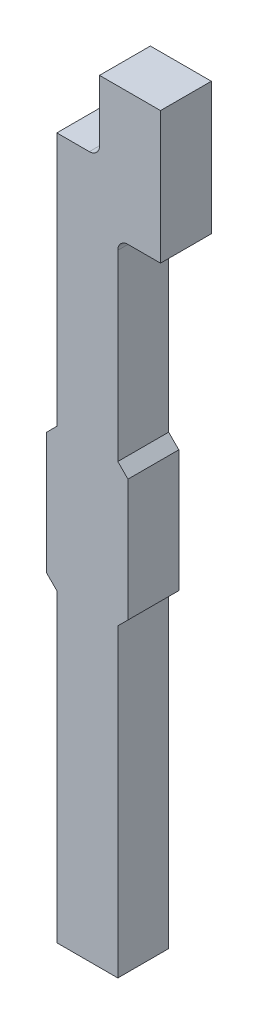
ISO-10303-21;
HEADER;
FILE_DESCRIPTION(('STEP AP214'),'2;1');
FILE_NAME('part.step','',(''),(''),'','','');
FILE_SCHEMA(('AUTOMOTIVE_DESIGN { 1 0 10303 214 1 1 1 1 }'));
ENDSEC;
DATA;
#1=APPLICATION_CONTEXT('core data for automotive mechanical design processes');
#2=APPLICATION_PROTOCOL_DEFINITION('international standard','automotive_design',2000,#1);
#3=PRODUCT_CONTEXT('',#1,'mechanical');
#4=PRODUCT('Part','Part','',(#3));
#5=PRODUCT_RELATED_PRODUCT_CATEGORY('part','',(#4));
#6=PRODUCT_DEFINITION_FORMATION('','',#4);
#7=PRODUCT_DEFINITION_CONTEXT('part definition',#1,'design');
#8=PRODUCT_DEFINITION('design','',#6,#7);
#9=PRODUCT_DEFINITION_SHAPE('','',#8);
#10=(LENGTH_UNIT() NAMED_UNIT(*) SI_UNIT(.MILLI.,.METRE.));
#11=(NAMED_UNIT(*) PLANE_ANGLE_UNIT() SI_UNIT($,.RADIAN.));
#12=(NAMED_UNIT(*) SI_UNIT($,.STERADIAN.) SOLID_ANGLE_UNIT());
#13=UNCERTAINTY_MEASURE_WITH_UNIT(LENGTH_MEASURE(1.E-05),#10,'distance_accuracy_value','');
#14=(GEOMETRIC_REPRESENTATION_CONTEXT(3) GLOBAL_UNCERTAINTY_ASSIGNED_CONTEXT((#13)) GLOBAL_UNIT_ASSIGNED_CONTEXT((#10,
#11,#12)) REPRESENTATION_CONTEXT('',''));
#15=CARTESIAN_POINT('',(0.,0.,0.));
#16=DIRECTION('',(0.,0.,1.));
#17=DIRECTION('',(1.,0.,0.));
#18=AXIS2_PLACEMENT_3D('',#15,#16,#17);
#19=CARTESIAN_POINT('',(-0.996637931034,-0.713362068966,0.));
#20=DIRECTION('',(0.,0.,1.));
#21=DIRECTION('',(1.,0.,0.));
#22=AXIS2_PLACEMENT_3D('',#19,#20,#21);
#23=PLANE('',#22);
#24=CARTESIAN_POINT('',(-1.25,-0.6,0.));
#25=DIRECTION('',(0.,0.,1.));
#26=DIRECTION('',(1.,0.,0.));
#27=AXIS2_PLACEMENT_3D('',#24,#25,#26);
#28=CIRCLE('',#27,0.1);
#29=CARTESIAN_POINT('',(-1.25,-0.7,0.));
#30=VERTEX_POINT('',#29);
#31=CARTESIAN_POINT('',(-1.15,-0.6,0.));
#32=VERTEX_POINT('',#31);
#33=EDGE_CURVE('E288',#30,#32,#28,.T.);
#34=ORIENTED_EDGE('',*,*,#33,.T.);
#35=DIRECTION('',(0.,1.,0.));
#36=VECTOR('',#35,1.);
#37=CARTESIAN_POINT('',(-1.15,-0.35,0.));
#38=LINE('',#37,#36);
#39=CARTESIAN_POINT('',(-1.15,0.,0.));
#40=VERTEX_POINT('',#39);
#41=EDGE_CURVE('E296',#40,#32,#38,.F.);
#42=ORIENTED_EDGE('',*,*,#41,.F.);
#43=DIRECTION('',(1.,0.,0.));
#44=VECTOR('',#43,1.);
#45=CARTESIAN_POINT('',(-0.996637931034,0.,0.));
#46=LINE('',#45,#44);
#47=CARTESIAN_POINT('',(-0.55,0.,0.));
#48=VERTEX_POINT('',#47);
#49=EDGE_CURVE('E299',#48,#40,#46,.F.);
#50=ORIENTED_EDGE('',*,*,#49,.F.);
#51=DIRECTION('',(0.,1.,0.));
#52=VECTOR('',#51,1.);
#53=CARTESIAN_POINT('',(-0.55,-0.713362068966,0.));
#54=LINE('',#53,#52);
#55=CARTESIAN_POINT('',(-0.55,-1.3,0.));
#56=VERTEX_POINT('',#55);
#57=EDGE_CURVE('E305',#56,#48,#54,.T.);
#58=ORIENTED_EDGE('',*,*,#57,.F.);
#59=DIRECTION('',(1.,0.,0.));
#60=VECTOR('',#59,1.);
#61=CARTESIAN_POINT('',(-0.996637931034,-1.3,0.));
#62=LINE('',#61,#60);
#63=CARTESIAN_POINT('',(-0.87,-1.3,0.));
#64=VERTEX_POINT('',#63);
#65=EDGE_CURVE('E144',#64,#56,#62,.T.);
#66=ORIENTED_EDGE('',*,*,#65,.F.);
#67=CARTESIAN_POINT('',(-0.87,-1.4,0.));
#68=DIRECTION('',(0.,0.,-1.));
#69=DIRECTION('',(-1.,0.,0.));
#70=AXIS2_PLACEMENT_3D('',#67,#68,#69);
#71=CIRCLE('',#70,0.1);
#72=CARTESIAN_POINT('',(-0.97,-1.4,0.));
#73=VERTEX_POINT('',#72);
#74=EDGE_CURVE('E20',#73,#64,#71,.T.);
#75=ORIENTED_EDGE('',*,*,#74,.F.);
#76=DIRECTION('',(0.,1.,0.));
#77=VECTOR('',#76,1.);
#78=CARTESIAN_POINT('',(-0.97,-2.25,0.));
#79=LINE('',#78,#77);
#80=CARTESIAN_POINT('',(-0.97,-3.2,0.));
#81=VERTEX_POINT('',#80);
#82=EDGE_CURVE('E141',#81,#73,#79,.T.);
#83=ORIENTED_EDGE('',*,*,#82,.F.);
#84=DIRECTION('',(-0.707106781186548,0.707106781186548,0.));
#85=VECTOR('',#84,1.);
#86=CARTESIAN_POINT('',(-0.91999999867,-3.25000000133,0.));
#87=LINE('',#86,#85);
#88=CARTESIAN_POINT('',(-0.869999997339,-3.300000002661,0.));
#89=VERTEX_POINT('',#88);
#90=EDGE_CURVE('E180',#89,#81,#87,.T.);
#91=ORIENTED_EDGE('',*,*,#90,.F.);
#92=DIRECTION('',(0.,1.,0.));
#93=VECTOR('',#92,1.);
#94=CARTESIAN_POINT('',(-0.869999997339,-3.900000002661,0.));
#95=LINE('',#94,#93);
#96=CARTESIAN_POINT('',(-0.869999997339166,-4.50000000266083,0.));
#97=VERTEX_POINT('',#96);
#98=EDGE_CURVE('E191',#97,#89,#95,.T.);
#99=ORIENTED_EDGE('',*,*,#98,.F.);
#100=DIRECTION('',(0.707106781186548,0.707106781186548,0.));
#101=VECTOR('',#100,1.);
#102=CARTESIAN_POINT('',(-0.91999999867,-4.550000003991,0.));
#103=LINE('',#102,#101);
#104=CARTESIAN_POINT('',(-0.970000001182667,-4.6000000057645,0.));
#105=VERTEX_POINT('',#104);
#106=EDGE_CURVE('E202',#105,#97,#103,.T.);
#107=ORIENTED_EDGE('',*,*,#106,.F.);
#108=DIRECTION('',(0.,1.,0.));
#109=VECTOR('',#108,1.);
#110=CARTESIAN_POINT('',(-0.970000002661,-6.100000002661,0.));
#111=LINE('',#110,#109);
#112=CARTESIAN_POINT('',(-0.970000002661,-7.600000002661,0.));
#113=VERTEX_POINT('',#112);
#114=EDGE_CURVE('E213',#113,#105,#111,.T.);
#115=ORIENTED_EDGE('',*,*,#114,.F.);
#116=DIRECTION('',(1.,0.,0.));
#117=VECTOR('',#116,1.);
#118=CARTESIAN_POINT('',(-1.270000002661,-7.600000002661,0.));
#119=LINE('',#118,#117);
#120=CARTESIAN_POINT('',(-1.570000002661,-7.600000002661,0.));
#121=VERTEX_POINT('',#120);
#122=EDGE_CURVE('E224',#121,#113,#119,.T.);
#123=ORIENTED_EDGE('',*,*,#122,.F.);
#124=DIRECTION('',(0.,1.,0.));
#125=VECTOR('',#124,1.);
#126=CARTESIAN_POINT('',(-1.570000002661,-6.100000002661,0.));
#127=LINE('',#126,#125);
#128=CARTESIAN_POINT('',(-1.57000000229133,-4.60000000450833,0.));
#129=VERTEX_POINT('',#128);
#130=EDGE_CURVE('E235',#129,#121,#127,.F.);
#131=ORIENTED_EDGE('',*,*,#130,.F.);
#132=DIRECTION('',(0.707106781186548,-0.707106781186548,0.));
#133=VECTOR('',#132,1.);
#134=CARTESIAN_POINT('',(-1.62000000133,-4.550000003991,0.));
#135=LINE('',#134,#133);
#136=CARTESIAN_POINT('',(-1.67000000266067,-4.5000000026605,0.));
#137=VERTEX_POINT('',#136);
#138=EDGE_CURVE('E246',#137,#129,#135,.T.);
#139=ORIENTED_EDGE('',*,*,#138,.F.);
#140=DIRECTION('',(0.,1.,0.));
#141=VECTOR('',#140,1.);
#142=CARTESIAN_POINT('',(-1.670000002661,-3.900000002661,0.));
#143=LINE('',#142,#141);
#144=CARTESIAN_POINT('',(-1.670000002661,-3.300000002661,0.));
#145=VERTEX_POINT('',#144);
#146=EDGE_CURVE('E257',#145,#137,#143,.F.);
#147=ORIENTED_EDGE('',*,*,#146,.F.);
#148=DIRECTION('',(-0.707106781186548,-0.707106781186548,0.));
#149=VECTOR('',#148,1.);
#150=CARTESIAN_POINT('',(-1.62000000133,-3.25000000133,0.));
#151=LINE('',#150,#149);
#152=CARTESIAN_POINT('',(-1.57,-3.2,0.));
#153=VERTEX_POINT('',#152);
#154=EDGE_CURVE('E268',#153,#145,#151,.T.);
#155=ORIENTED_EDGE('',*,*,#154,.F.);
#156=DIRECTION('',(0.,1.,0.));
#157=VECTOR('',#156,1.);
#158=CARTESIAN_POINT('',(-1.57,-1.,0.));
#159=LINE('',#158,#157);
#160=CARTESIAN_POINT('',(-1.57,-0.7,0.));
#161=VERTEX_POINT('',#160);
#162=EDGE_CURVE('E279',#161,#153,#159,.F.);
#163=ORIENTED_EDGE('',*,*,#162,.F.);
#164=DIRECTION('',(1.,0.,0.));
#165=VECTOR('',#164,1.);
#166=CARTESIAN_POINT('',(-1.36,-0.7,0.));
#167=LINE('',#166,#165);
#168=EDGE_CURVE('E285',#30,#161,#167,.F.);
#169=ORIENTED_EDGE('',*,*,#168,.F.);
#170=EDGE_LOOP('',(#34,#42,#50,#58,#66,#75,#83,#91,#99,#107,#115,#123,#131,#139,#147,#155,#163,#169));
#171=FACE_BOUND('',#170,.T.);
#172=ADVANCED_FACE('F17',(#171),#23,.F.);
#173=CARTESIAN_POINT('',(-1.15,-0.35,0.));
#174=DIRECTION('',(-1.,0.,0.));
#175=DIRECTION('',(0.,0.,1.));
#176=AXIS2_PLACEMENT_3D('',#173,#174,#175);
#177=PLANE('',#176);
#178=DIRECTION('',(0.,0.,1.));
#179=VECTOR('',#178,1.);
#180=CARTESIAN_POINT('',(-1.15,-0.6,0.));
#181=LINE('',#180,#179);
#182=CARTESIAN_POINT('',(-1.15,-0.6,0.5));
#183=VERTEX_POINT('',#182);
#184=EDGE_CURVE('E286',#32,#183,#181,.T.);
#185=ORIENTED_EDGE('',*,*,#184,.T.);
#186=DIRECTION('',(0.,1.,0.));
#187=VECTOR('',#186,1.);
#188=CARTESIAN_POINT('',(-1.15,-0.713362068966,0.5));
#189=LINE('',#188,#187);
#190=CARTESIAN_POINT('',(-1.15,0.,0.5));
#191=VERTEX_POINT('',#190);
#192=EDGE_CURVE('E355',#191,#183,#189,.F.);
#193=ORIENTED_EDGE('',*,*,#192,.F.);
#194=DIRECTION('',(0.,0.,1.));
#195=VECTOR('',#194,1.);
#196=CARTESIAN_POINT('',(-1.15,0.,0.));
#197=LINE('',#196,#195);
#198=EDGE_CURVE('E289',#40,#191,#197,.T.);
#199=ORIENTED_EDGE('',*,*,#198,.F.);
#200=ORIENTED_EDGE('',*,*,#41,.T.);
#201=EDGE_LOOP('',(#185,#193,#199,#200));
#202=FACE_BOUND('',#201,.T.);
#203=ADVANCED_FACE('F372',(#202),#177,.T.);
#204=CARTESIAN_POINT('',(-1.25,-0.6,0.));
#205=DIRECTION('',(0.,0.,1.));
#206=DIRECTION('',(1.,0.,0.));
#207=AXIS2_PLACEMENT_3D('',#204,#205,#206);
#208=CYLINDRICAL_SURFACE('',#207,0.1);
#209=CARTESIAN_POINT('',(-1.25,-0.6,0.5));
#210=DIRECTION('',(0.,0.,1.));
#211=DIRECTION('',(1.,0.,0.));
#212=AXIS2_PLACEMENT_3D('',#209,#210,#211);
#213=CIRCLE('',#212,0.1);
#214=CARTESIAN_POINT('',(-1.25,-0.7,0.5));
#215=VERTEX_POINT('',#214);
#216=EDGE_CURVE('E363',#183,#215,#213,.F.);
#217=ORIENTED_EDGE('',*,*,#216,.F.);
#218=ORIENTED_EDGE('',*,*,#184,.F.);
#219=ORIENTED_EDGE('',*,*,#33,.F.);
#220=DIRECTION('',(0.,0.,1.));
#221=VECTOR('',#220,1.);
#222=CARTESIAN_POINT('',(-1.25,-0.7,0.));
#223=LINE('',#222,#221);
#224=EDGE_CURVE('E282',#215,#30,#223,.F.);
#225=ORIENTED_EDGE('',*,*,#224,.F.);
#226=EDGE_LOOP('',(#217,#218,#219,#225));
#227=FACE_BOUND('',#226,.T.);
#228=ADVANCED_FACE('F374',(#227),#208,.F.);
#229=CARTESIAN_POINT('',(-1.36,-0.7,0.));
#230=DIRECTION('',(0.,1.,0.));
#231=DIRECTION('',(0.,0.,1.));
#232=AXIS2_PLACEMENT_3D('',#229,#230,#231);
#233=PLANE('',#232);
#234=ORIENTED_EDGE('',*,*,#224,.T.);
#235=ORIENTED_EDGE('',*,*,#168,.T.);
#236=DIRECTION('',(0.,0.,1.));
#237=VECTOR('',#236,1.);
#238=CARTESIAN_POINT('',(-1.57,-0.7,0.));
#239=LINE('',#238,#237);
#240=CARTESIAN_POINT('',(-1.57,-0.7,0.5));
#241=VERTEX_POINT('',#240);
#242=EDGE_CURVE('E276',#241,#161,#239,.F.);
#243=ORIENTED_EDGE('',*,*,#242,.F.);
#244=DIRECTION('',(1.,0.,0.));
#245=VECTOR('',#244,1.);
#246=CARTESIAN_POINT('',(-0.996637931034,-0.7,0.5));
#247=LINE('',#246,#245);
#248=EDGE_CURVE('E273',#215,#241,#247,.F.);
#249=ORIENTED_EDGE('',*,*,#248,.F.);
#250=EDGE_LOOP('',(#234,#235,#243,#249));
#251=FACE_BOUND('',#250,.T.);
#252=ADVANCED_FACE('F405',(#251),#233,.T.);
#253=CARTESIAN_POINT('',(-1.57,-1.,0.));
#254=DIRECTION('',(-1.,0.,0.));
#255=DIRECTION('',(0.,0.,1.));
#256=AXIS2_PLACEMENT_3D('',#253,#254,#255);
#257=PLANE('',#256);
#258=DIRECTION('',(0.,1.,0.));
#259=VECTOR('',#258,1.);
#260=CARTESIAN_POINT('',(-1.57,-0.713362068966,0.5));
#261=LINE('',#260,#259);
#262=CARTESIAN_POINT('',(-1.57,-3.2,0.5));
#263=VERTEX_POINT('',#262);
#264=EDGE_CURVE('E262',#241,#263,#261,.F.);
#265=ORIENTED_EDGE('',*,*,#264,.F.);
#266=ORIENTED_EDGE('',*,*,#242,.T.);
#267=ORIENTED_EDGE('',*,*,#162,.T.);
#268=DIRECTION('',(0.,0.,1.));
#269=VECTOR('',#268,1.);
#270=CARTESIAN_POINT('',(-1.57,-3.2,0.));
#271=LINE('',#270,#269);
#272=EDGE_CURVE('E265',#263,#153,#271,.F.);
#273=ORIENTED_EDGE('',*,*,#272,.F.);
#274=EDGE_LOOP('',(#265,#266,#267,#273));
#275=FACE_BOUND('',#274,.T.);
#276=ADVANCED_FACE('F407',(#275),#257,.T.);
#277=CARTESIAN_POINT('',(-1.62000000133,-3.25000000133,0.));
#278=DIRECTION('',(-0.707106781186548,0.707106781186548,0.));
#279=DIRECTION('',(-0.707106781186548,-0.707106781186548,0.));
#280=AXIS2_PLACEMENT_3D('',#277,#278,#279);
#281=PLANE('',#280);
#282=DIRECTION('',(-0.707106781186547,-0.707106781186547,0.));
#283=VECTOR('',#282,1.);
#284=CARTESIAN_POINT('',(-1.57,-3.2,0.5));
#285=LINE('',#284,#283);
#286=CARTESIAN_POINT('',(-1.670000002661,-3.300000002661,0.5));
#287=VERTEX_POINT('',#286);
#288=EDGE_CURVE('E251',#263,#287,#285,.T.);
#289=ORIENTED_EDGE('',*,*,#288,.F.);
#290=ORIENTED_EDGE('',*,*,#272,.T.);
#291=ORIENTED_EDGE('',*,*,#154,.T.);
#292=DIRECTION('',(0.,0.,1.));
#293=VECTOR('',#292,1.);
#294=CARTESIAN_POINT('',(-1.670000002661,-3.300000002661,0.));
#295=LINE('',#294,#293);
#296=EDGE_CURVE('E254',#287,#145,#295,.F.);
#297=ORIENTED_EDGE('',*,*,#296,.F.);
#298=EDGE_LOOP('',(#289,#290,#291,#297));
#299=FACE_BOUND('',#298,.T.);
#300=ADVANCED_FACE('F410',(#299),#281,.T.);
#301=CARTESIAN_POINT('',(-1.670000002661,-3.900000002661,0.));
#302=DIRECTION('',(-1.,0.,0.));
#303=DIRECTION('',(0.,0.,1.));
#304=AXIS2_PLACEMENT_3D('',#301,#302,#303);
#305=PLANE('',#304);
#306=DIRECTION('',(0.,1.,0.));
#307=VECTOR('',#306,1.);
#308=CARTESIAN_POINT('',(-1.670000002661,-0.713362068966,0.5));
#309=LINE('',#308,#307);
#310=CARTESIAN_POINT('',(-1.67000000266083,-4.50000000266083,0.5));
#311=VERTEX_POINT('',#310);
#312=EDGE_CURVE('E240',#287,#311,#309,.F.);
#313=ORIENTED_EDGE('',*,*,#312,.F.);
#314=ORIENTED_EDGE('',*,*,#296,.T.);
#315=ORIENTED_EDGE('',*,*,#146,.T.);
#316=DIRECTION('',(0.,0.,1.));
#317=VECTOR('',#316,1.);
#318=CARTESIAN_POINT('',(-1.6700000026605,-4.5000000026605,0.));
#319=LINE('',#318,#317);
#320=EDGE_CURVE('E243',#311,#137,#319,.F.);
#321=ORIENTED_EDGE('',*,*,#320,.F.);
#322=EDGE_LOOP('',(#313,#314,#315,#321));
#323=FACE_BOUND('',#322,.T.);
#324=ADVANCED_FACE('F414',(#323),#305,.T.);
#325=CARTESIAN_POINT('',(-1.62000000133,-4.550000003991,0.));
#326=DIRECTION('',(-0.707106781186548,-0.707106781186548,0.));
#327=DIRECTION('',(0.707106781186548,-0.707106781186548,0.));
#328=AXIS2_PLACEMENT_3D('',#325,#326,#327);
#329=PLANE('',#328);
#330=DIRECTION('',(0.707106774918049,-0.707106787455047,0.));
#331=VECTOR('',#330,1.);
#332=CARTESIAN_POINT('',(-1.670000002661,-4.500000002661,0.5));
#333=LINE('',#332,#331);
#334=CARTESIAN_POINT('',(-1.570000002365,-4.600000004878,0.5));
#335=VERTEX_POINT('',#334);
#336=EDGE_CURVE('E229',#311,#335,#333,.T.);
#337=ORIENTED_EDGE('',*,*,#336,.F.);
#338=ORIENTED_EDGE('',*,*,#320,.T.);
#339=ORIENTED_EDGE('',*,*,#138,.T.);
#340=DIRECTION('',(0.,0.,1.));
#341=VECTOR('',#340,1.);
#342=CARTESIAN_POINT('',(-1.570000002661,-4.600000004878,0.));
#343=LINE('',#342,#341);
#344=EDGE_CURVE('E232',#335,#129,#343,.F.);
#345=ORIENTED_EDGE('',*,*,#344,.F.);
#346=EDGE_LOOP('',(#337,#338,#339,#345));
#347=FACE_BOUND('',#346,.T.);
#348=ADVANCED_FACE('F416',(#347),#329,.T.);
#349=CARTESIAN_POINT('',(-1.570000002661,-6.100000002661,0.));
#350=DIRECTION('',(-1.,0.,0.));
#351=DIRECTION('',(0.,0.,1.));
#352=AXIS2_PLACEMENT_3D('',#349,#350,#351);
#353=PLANE('',#352);
#354=DIRECTION('',(0.,1.,0.));
#355=VECTOR('',#354,1.);
#356=CARTESIAN_POINT('',(-1.570000002217,-0.713362068966,0.5));
#357=LINE('',#356,#355);
#358=CARTESIAN_POINT('',(-1.570000002365,-7.600000002661,0.5));
#359=VERTEX_POINT('',#358);
#360=EDGE_CURVE('E218',#335,#359,#357,.F.);
#361=ORIENTED_EDGE('',*,*,#360,.F.);
#362=ORIENTED_EDGE('',*,*,#344,.T.);
#363=ORIENTED_EDGE('',*,*,#130,.T.);
#364=DIRECTION('',(0.,0.,-1.));
#365=VECTOR('',#364,1.);
#366=CARTESIAN_POINT('',(-1.570000002661,-7.600000002661,0.));
#367=LINE('',#366,#365);
#368=EDGE_CURVE('E221',#359,#121,#367,.T.);
#369=ORIENTED_EDGE('',*,*,#368,.F.);
#370=EDGE_LOOP('',(#361,#362,#363,#369));
#371=FACE_BOUND('',#370,.T.);
#372=ADVANCED_FACE('F419',(#371),#353,.T.);
#373=CARTESIAN_POINT('',(-1.270000002661,-7.600000002661,0.));
#374=DIRECTION('',(0.,-1.,0.));
#375=DIRECTION('',(0.,0.,-1.));
#376=AXIS2_PLACEMENT_3D('',#373,#374,#375);
#377=PLANE('',#376);
#378=DIRECTION('',(1.,0.,0.));
#379=VECTOR('',#378,1.);
#380=CARTESIAN_POINT('',(-0.996637931034,-7.600000002661,0.5));
#381=LINE('',#380,#379);
#382=CARTESIAN_POINT('',(-0.970000002661,-7.600000002661,0.5));
#383=VERTEX_POINT('',#382);
#384=EDGE_CURVE('E207',#359,#383,#381,.T.);
#385=ORIENTED_EDGE('',*,*,#384,.F.);
#386=ORIENTED_EDGE('',*,*,#368,.T.);
#387=ORIENTED_EDGE('',*,*,#122,.T.);
#388=DIRECTION('',(0.,0.,1.));
#389=VECTOR('',#388,1.);
#390=CARTESIAN_POINT('',(-0.970000002661,-7.600000002661,0.));
#391=LINE('',#390,#389);
#392=EDGE_CURVE('E210',#383,#113,#391,.F.);
#393=ORIENTED_EDGE('',*,*,#392,.F.);
#394=EDGE_LOOP('',(#385,#386,#387,#393));
#395=FACE_BOUND('',#394,.T.);
#396=ADVANCED_FACE('F423',(#395),#377,.T.);
#397=CARTESIAN_POINT('',(-0.970000002661,-6.100000002661,0.));
#398=DIRECTION('',(1.,0.,0.));
#399=DIRECTION('',(0.,1.,0.));
#400=AXIS2_PLACEMENT_3D('',#397,#398,#399);
#401=PLANE('',#400);
#402=DIRECTION('',(0.,1.,0.));
#403=VECTOR('',#402,1.);
#404=CARTESIAN_POINT('',(-0.970000002661,-0.713362068966,0.5));
#405=LINE('',#404,#403);
#406=CARTESIAN_POINT('',(-0.970000001921833,-4.6000000066515,0.5));
#407=VERTEX_POINT('',#406);
#408=EDGE_CURVE('E196',#383,#407,#405,.T.);
#409=ORIENTED_EDGE('',*,*,#408,.F.);
#410=ORIENTED_EDGE('',*,*,#392,.T.);
#411=ORIENTED_EDGE('',*,*,#114,.T.);
#412=DIRECTION('',(0.,0.,1.));
#413=VECTOR('',#412,1.);
#414=CARTESIAN_POINT('',(-0.9700000004435,-4.6000000057645,0.));
#415=LINE('',#414,#413);
#416=EDGE_CURVE('E199',#407,#105,#415,.F.);
#417=ORIENTED_EDGE('',*,*,#416,.F.);
#418=EDGE_LOOP('',(#409,#410,#411,#417));
#419=FACE_BOUND('',#418,.T.);
#420=ADVANCED_FACE('F425',(#419),#401,.T.);
#421=CARTESIAN_POINT('',(-0.91999999867,-4.550000003991,0.));
#422=DIRECTION('',(0.707106781186548,-0.707106781186548,0.));
#423=DIRECTION('',(0.707106781186548,0.707106781186548,0.));
#424=AXIS2_PLACEMENT_3D('',#421,#422,#423);
#425=PLANE('',#424);
#426=DIRECTION('',(0.707106784326102,0.707106778046994,0.));
#427=VECTOR('',#426,1.);
#428=CARTESIAN_POINT('',(-0.970000000887,-4.600000005321,0.5));
#429=LINE('',#428,#427);
#430=CARTESIAN_POINT('',(-0.869999997339,-4.500000002661,0.5));
#431=VERTEX_POINT('',#430);
#432=EDGE_CURVE('E185',#407,#431,#429,.T.);
#433=ORIENTED_EDGE('',*,*,#432,.F.);
#434=ORIENTED_EDGE('',*,*,#416,.T.);
#435=ORIENTED_EDGE('',*,*,#106,.T.);
#436=DIRECTION('',(0.,0.,1.));
#437=VECTOR('',#436,1.);
#438=CARTESIAN_POINT('',(-0.869999997338999,-4.500000002661,0.));
#439=LINE('',#438,#437);
#440=EDGE_CURVE('E188',#431,#97,#439,.F.);
#441=ORIENTED_EDGE('',*,*,#440,.F.);
#442=EDGE_LOOP('',(#433,#434,#435,#441));
#443=FACE_BOUND('',#442,.T.);
#444=ADVANCED_FACE('F428',(#443),#425,.T.);
#445=CARTESIAN_POINT('',(-0.869999997339,-3.900000002661,0.));
#446=DIRECTION('',(1.,0.,0.));
#447=DIRECTION('',(0.,1.,0.));
#448=AXIS2_PLACEMENT_3D('',#445,#446,#447);
#449=PLANE('',#448);
#450=DIRECTION('',(0.,1.,0.));
#451=VECTOR('',#450,1.);
#452=CARTESIAN_POINT('',(-0.869999997339,-0.713362068966,0.5));
#453=LINE('',#452,#451);
#454=CARTESIAN_POINT('',(-0.869999997339,-3.300000002661,0.5));
#455=VERTEX_POINT('',#454);
#456=EDGE_CURVE('E175',#431,#455,#453,.T.);
#457=ORIENTED_EDGE('',*,*,#456,.F.);
#458=ORIENTED_EDGE('',*,*,#440,.T.);
#459=ORIENTED_EDGE('',*,*,#98,.T.);
#460=DIRECTION('',(0.,0.,1.));
#461=VECTOR('',#460,1.);
#462=CARTESIAN_POINT('',(-0.869999997339,-3.300000002661,0.));
#463=LINE('',#462,#461);
#464=EDGE_CURVE('E168',#455,#89,#463,.F.);
#465=ORIENTED_EDGE('',*,*,#464,.F.);
#466=EDGE_LOOP('',(#457,#458,#459,#465));
#467=FACE_BOUND('',#466,.T.);
#468=ADVANCED_FACE('F432',(#467),#449,.T.);
#469=CARTESIAN_POINT('',(-0.91999999867,-3.25000000133,0.));
#470=DIRECTION('',(0.707106781186548,0.707106781186548,0.));
#471=DIRECTION('',(-0.707106781186548,0.707106781186548,0.));
#472=AXIS2_PLACEMENT_3D('',#469,#470,#471);
#473=PLANE('',#472);
#474=DIRECTION('',(-0.707106781186547,0.707106781186548,0.));
#475=VECTOR('',#474,1.);
#476=CARTESIAN_POINT('',(-0.869999997339,-3.300000002661,0.5));
#477=LINE('',#476,#475);
#478=CARTESIAN_POINT('',(-0.97,-3.2,0.5));
#479=VERTEX_POINT('',#478);
#480=EDGE_CURVE('E171',#455,#479,#477,.T.);
#481=ORIENTED_EDGE('',*,*,#480,.F.);
#482=ORIENTED_EDGE('',*,*,#464,.T.);
#483=ORIENTED_EDGE('',*,*,#90,.T.);
#484=DIRECTION('',(0.,0.,-1.));
#485=VECTOR('',#484,1.);
#486=CARTESIAN_POINT('',(-0.97,-3.2,0.));
#487=LINE('',#486,#485);
#488=EDGE_CURVE('E153',#479,#81,#487,.T.);
#489=ORIENTED_EDGE('',*,*,#488,.F.);
#490=EDGE_LOOP('',(#481,#482,#483,#489));
#491=FACE_BOUND('',#490,.T.);
#492=ADVANCED_FACE('F434',(#491),#473,.T.);
#493=CARTESIAN_POINT('',(-0.97,-2.25,0.));
#494=DIRECTION('',(1.,0.,0.));
#495=DIRECTION('',(0.,0.,-1.));
#496=AXIS2_PLACEMENT_3D('',#493,#494,#495);
#497=PLANE('',#496);
#498=DIRECTION('',(0.,0.,-1.));
#499=VECTOR('',#498,1.);
#500=CARTESIAN_POINT('',(-0.97,-1.4,0.));
#501=LINE('',#500,#499);
#502=CARTESIAN_POINT('',(-0.97,-1.4,0.5));
#503=VERTEX_POINT('',#502);
#504=EDGE_CURVE('E151',#73,#503,#501,.F.);
#505=ORIENTED_EDGE('',*,*,#504,.T.);
#506=DIRECTION('',(0.,1.,0.));
#507=VECTOR('',#506,1.);
#508=CARTESIAN_POINT('',(-0.97,-0.713362068966,0.5));
#509=LINE('',#508,#507);
#510=EDGE_CURVE('E174',#479,#503,#509,.T.);
#511=ORIENTED_EDGE('',*,*,#510,.F.);
#512=ORIENTED_EDGE('',*,*,#488,.T.);
#513=ORIENTED_EDGE('',*,*,#82,.T.);
#514=EDGE_LOOP('',(#505,#511,#512,#513));
#515=FACE_BOUND('',#514,.T.);
#516=ADVANCED_FACE('F149',(#515),#497,.T.);
#517=CARTESIAN_POINT('',(-0.87,-1.4,0.));
#518=DIRECTION('',(0.,0.,-1.));
#519=DIRECTION('',(-1.,0.,0.));
#520=AXIS2_PLACEMENT_3D('',#517,#518,#519);
#521=CYLINDRICAL_SURFACE('',#520,0.1);
#522=ORIENTED_EDGE('',*,*,#74,.T.);
#523=DIRECTION('',(0.,0.,-1.));
#524=VECTOR('',#523,1.);
#525=CARTESIAN_POINT('',(-0.87,-1.3,0.));
#526=LINE('',#525,#524);
#527=CARTESIAN_POINT('',(-0.87,-1.3,0.5));
#528=VERTEX_POINT('',#527);
#529=EDGE_CURVE('E159',#528,#64,#526,.T.);
#530=ORIENTED_EDGE('',*,*,#529,.F.);
#531=CARTESIAN_POINT('',(-0.87,-1.4,0.5));
#532=DIRECTION('',(0.,0.,-1.));
#533=DIRECTION('',(-1.,0.,0.));
#534=AXIS2_PLACEMENT_3D('',#531,#532,#533);
#535=CIRCLE('',#534,0.1);
#536=EDGE_CURVE('E157',#503,#528,#535,.T.);
#537=ORIENTED_EDGE('',*,*,#536,.F.);
#538=ORIENTED_EDGE('',*,*,#504,.F.);
#539=EDGE_LOOP('',(#522,#530,#537,#538));
#540=FACE_BOUND('',#539,.T.);
#541=ADVANCED_FACE('F155',(#540),#521,.F.);
#542=CARTESIAN_POINT('',(-1.06,-1.3,0.));
#543=DIRECTION('',(0.,-1.,0.));
#544=DIRECTION('',(0.,0.,-1.));
#545=AXIS2_PLACEMENT_3D('',#542,#543,#544);
#546=PLANE('',#545);
#547=ORIENTED_EDGE('',*,*,#529,.T.);
#548=ORIENTED_EDGE('',*,*,#65,.T.);
#549=DIRECTION('',(0.,0.,-1.));
#550=VECTOR('',#549,1.);
#551=CARTESIAN_POINT('',(-0.55,-1.3,0.));
#552=LINE('',#551,#550);
#553=CARTESIAN_POINT('',(-0.55,-1.3,0.5));
#554=VERTEX_POINT('',#553);
#555=EDGE_CURVE('E161',#554,#56,#552,.T.);
#556=ORIENTED_EDGE('',*,*,#555,.F.);
#557=DIRECTION('',(1.,0.,0.));
#558=VECTOR('',#557,1.);
#559=CARTESIAN_POINT('',(-0.996637931034,-1.3,0.5));
#560=LINE('',#559,#558);
#561=EDGE_CURVE('E362',#528,#554,#560,.T.);
#562=ORIENTED_EDGE('',*,*,#561,.F.);
#563=EDGE_LOOP('',(#547,#548,#556,#562));
#564=FACE_BOUND('',#563,.T.);
#565=ADVANCED_FACE('F453',(#564),#546,.T.);
#566=CARTESIAN_POINT('',(-0.55,-0.65,0.));
#567=DIRECTION('',(1.,0.,0.));
#568=DIRECTION('',(0.,0.,-1.));
#569=AXIS2_PLACEMENT_3D('',#566,#567,#568);
#570=PLANE('',#569);
#571=DIRECTION('',(0.,1.,0.));
#572=VECTOR('',#571,1.);
#573=CARTESIAN_POINT('',(-0.55,-0.713362068966,0.5));
#574=LINE('',#573,#572);
#575=CARTESIAN_POINT('',(-0.55,0.,0.5));
#576=VERTEX_POINT('',#575);
#577=EDGE_CURVE('E26',#554,#576,#574,.T.);
#578=ORIENTED_EDGE('',*,*,#577,.F.);
#579=ORIENTED_EDGE('',*,*,#555,.T.);
#580=ORIENTED_EDGE('',*,*,#57,.T.);
#581=DIRECTION('',(0.,0.,1.));
#582=VECTOR('',#581,1.);
#583=CARTESIAN_POINT('',(-0.55,0.,0.));
#584=LINE('',#583,#582);
#585=EDGE_CURVE('E35',#576,#48,#584,.F.);
#586=ORIENTED_EDGE('',*,*,#585,.F.);
#587=EDGE_LOOP('',(#578,#579,#580,#586));
#588=FACE_BOUND('',#587,.T.);
#589=ADVANCED_FACE('F391',(#588),#570,.T.);
#590=CARTESIAN_POINT('',(-0.85,0.,0.));
#591=DIRECTION('',(0.,1.,0.));
#592=DIRECTION('',(-1.,0.,0.));
#593=AXIS2_PLACEMENT_3D('',#590,#591,#592);
#594=PLANE('',#593);
#595=DIRECTION('',(1.,0.,0.));
#596=VECTOR('',#595,1.);
#597=CARTESIAN_POINT('',(-0.996637931034,0.,0.5));
#598=LINE('',#597,#596);
#599=EDGE_CURVE('E11',#576,#191,#598,.F.);
#600=ORIENTED_EDGE('',*,*,#599,.F.);
#601=ORIENTED_EDGE('',*,*,#585,.T.);
#602=ORIENTED_EDGE('',*,*,#49,.T.);
#603=ORIENTED_EDGE('',*,*,#198,.T.);
#604=EDGE_LOOP('',(#600,#601,#602,#603));
#605=FACE_BOUND('',#604,.T.);
#606=ADVANCED_FACE('F396',(#605),#594,.T.);
#607=CARTESIAN_POINT('',(-0.996637931034,-0.713362068966,0.5));
#608=DIRECTION('',(0.,0.,1.));
#609=DIRECTION('',(1.,0.,0.));
#610=AXIS2_PLACEMENT_3D('',#607,#608,#609);
#611=PLANE('',#610);
#612=ORIENTED_EDGE('',*,*,#577,.T.);
#613=ORIENTED_EDGE('',*,*,#599,.T.);
#614=ORIENTED_EDGE('',*,*,#192,.T.);
#615=ORIENTED_EDGE('',*,*,#216,.T.);
#616=ORIENTED_EDGE('',*,*,#248,.T.);
#617=ORIENTED_EDGE('',*,*,#264,.T.);
#618=ORIENTED_EDGE('',*,*,#288,.T.);
#619=ORIENTED_EDGE('',*,*,#312,.T.);
#620=ORIENTED_EDGE('',*,*,#336,.T.);
#621=ORIENTED_EDGE('',*,*,#360,.T.);
#622=ORIENTED_EDGE('',*,*,#384,.T.);
#623=ORIENTED_EDGE('',*,*,#408,.T.);
#624=ORIENTED_EDGE('',*,*,#432,.T.);
#625=ORIENTED_EDGE('',*,*,#456,.T.);
#626=ORIENTED_EDGE('',*,*,#480,.T.);
#627=ORIENTED_EDGE('',*,*,#510,.T.);
#628=ORIENTED_EDGE('',*,*,#536,.T.);
#629=ORIENTED_EDGE('',*,*,#561,.T.);
#630=EDGE_LOOP('',(#612,#613,#614,#615,#616,#617,#618,#619,#620,#621,#622,#623,#624,#625,#626,
#627,#628,#629));
#631=FACE_BOUND('',#630,.T.);
#632=ADVANCED_FACE('F380',(#631),#611,.T.);
#633=CLOSED_SHELL('',(#172,#203,#228,#252,#276,#300,#324,#348,#372,#396,#420,#444,#468,#492,
#516,#541,#565,#589,#606,#632));
#634=MANIFOLD_SOLID_BREP('B1',#633);
#635=ADVANCED_BREP_SHAPE_REPRESENTATION('',(#18,#634),#14);
#636=SHAPE_DEFINITION_REPRESENTATION(#9,#635);
ENDSEC;
END-ISO-10303-21;
